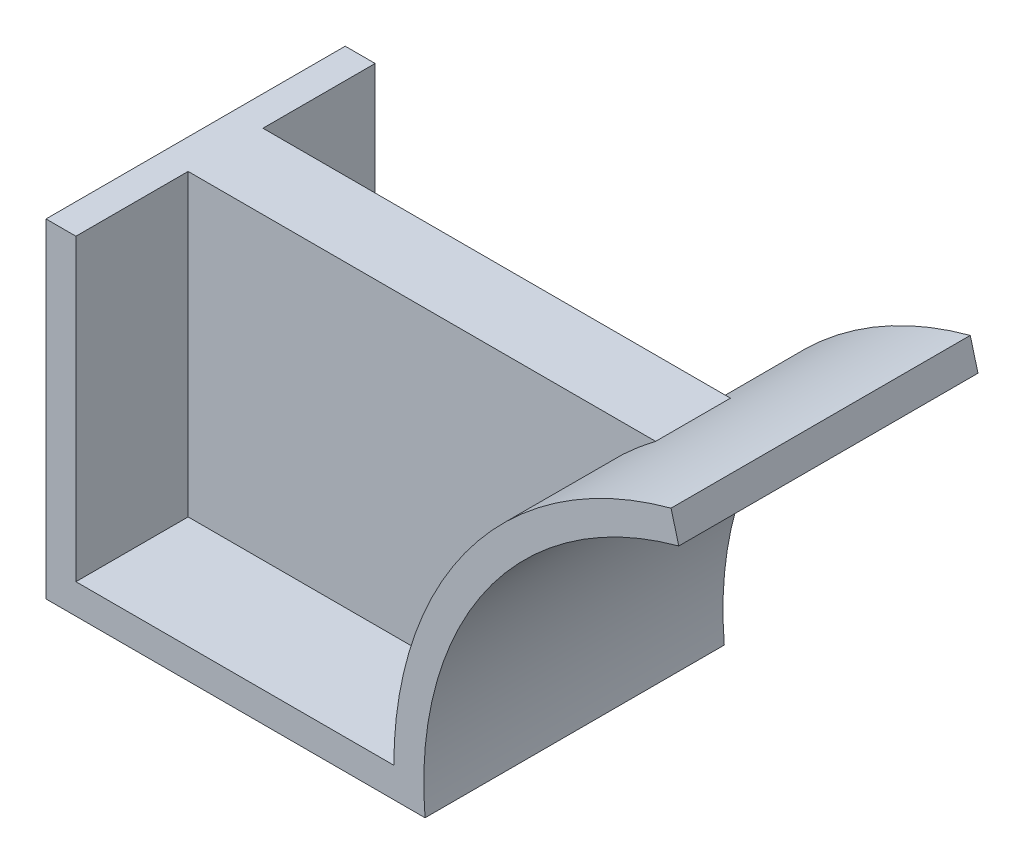
ISO-10303-21;
HEADER;
FILE_DESCRIPTION(('STEP AP214'),'2;1');
FILE_NAME('part.step','',(''),(''),'','','');
FILE_SCHEMA(('AUTOMOTIVE_DESIGN { 1 0 10303 214 1 1 1 1 }'));
ENDSEC;
DATA;
#1=APPLICATION_CONTEXT('core data for automotive mechanical design processes');
#2=APPLICATION_PROTOCOL_DEFINITION('international standard','automotive_design',2000,#1);
#3=PRODUCT_CONTEXT('',#1,'mechanical');
#4=PRODUCT('Part','Part','',(#3));
#5=PRODUCT_RELATED_PRODUCT_CATEGORY('part','',(#4));
#6=PRODUCT_DEFINITION_FORMATION('','',#4);
#7=PRODUCT_DEFINITION_CONTEXT('part definition',#1,'design');
#8=PRODUCT_DEFINITION('design','',#6,#7);
#9=PRODUCT_DEFINITION_SHAPE('','',#8);
#10=(LENGTH_UNIT() NAMED_UNIT(*) SI_UNIT(.MILLI.,.METRE.));
#11=(NAMED_UNIT(*) PLANE_ANGLE_UNIT() SI_UNIT($,.RADIAN.));
#12=(NAMED_UNIT(*) SI_UNIT($,.STERADIAN.) SOLID_ANGLE_UNIT());
#13=UNCERTAINTY_MEASURE_WITH_UNIT(LENGTH_MEASURE(1.E-05),#10,'distance_accuracy_value','');
#14=(GEOMETRIC_REPRESENTATION_CONTEXT(3) GLOBAL_UNCERTAINTY_ASSIGNED_CONTEXT((#13)) GLOBAL_UNIT_ASSIGNED_CONTEXT((#10,
#11,#12)) REPRESENTATION_CONTEXT('',''));
#15=CARTESIAN_POINT('',(0.,0.,0.));
#16=DIRECTION('',(0.,0.,1.));
#17=DIRECTION('',(1.,0.,0.));
#18=AXIS2_PLACEMENT_3D('',#15,#16,#17);
#19=CARTESIAN_POINT('',(185.,0.,80.));
#20=DIRECTION('',(0.,0.,-1.));
#21=DIRECTION('',(-1.,0.,0.));
#22=AXIS2_PLACEMENT_3D('',#19,#20,#21);
#23=CYLINDRICAL_SURFACE('',#22,100.);
#24=DIRECTION('',(0.,0.,-1.));
#25=VECTOR('',#24,1.);
#26=CARTESIAN_POINT('',(85.,0.,80.));
#27=LINE('',#26,#25);
#28=CARTESIAN_POINT('',(85.,0.,29.9999999999999));
#29=VERTEX_POINT('',#28);
#30=CARTESIAN_POINT('',(85.,0.,0.));
#31=VERTEX_POINT('',#30);
#32=EDGE_CURVE('E171',#29,#31,#27,.T.);
#33=ORIENTED_EDGE('',*,*,#32,.F.);
#34=CARTESIAN_POINT('',(185.,0.,30.));
#35=DIRECTION('',(0.,0.,1.));
#36=DIRECTION('',(0.,-1.,0.));
#37=AXIS2_PLACEMENT_3D('',#34,#35,#36);
#38=CIRCLE('',#37,100.);
#39=CARTESIAN_POINT('',(125.,80.,30.));
#40=VERTEX_POINT('',#39);
#41=EDGE_CURVE('E199',#40,#29,#38,.T.);
#42=ORIENTED_EDGE('',*,*,#41,.F.);
#43=DIRECTION('',(0.,0.,-1.));
#44=VECTOR('',#43,1.);
#45=CARTESIAN_POINT('',(125.,80.,80.));
#46=LINE('',#45,#44);
#47=CARTESIAN_POINT('',(125.,80.,50.));
#48=VERTEX_POINT('',#47);
#49=EDGE_CURVE('E227',#48,#40,#46,.T.);
#50=ORIENTED_EDGE('',*,*,#49,.F.);
#51=CARTESIAN_POINT('',(185.,0.,50.));
#52=DIRECTION('',(0.,0.,-1.));
#53=DIRECTION('',(-1.,0.,0.));
#54=AXIS2_PLACEMENT_3D('',#51,#52,#53);
#55=CIRCLE('',#54,100.);
#56=CARTESIAN_POINT('',(85.,0.,50.));
#57=VERTEX_POINT('',#56);
#58=EDGE_CURVE('E147',#57,#48,#55,.T.);
#59=ORIENTED_EDGE('',*,*,#58,.F.);
#60=CARTESIAN_POINT('',(85.,0.,80.));
#61=VERTEX_POINT('',#60);
#62=EDGE_CURVE('E172',#61,#57,#27,.T.);
#63=ORIENTED_EDGE('',*,*,#62,.F.);
#64=CARTESIAN_POINT('',(185.,0.,80.));
#65=DIRECTION('',(0.,0.,-1.));
#66=DIRECTION('',(-1.,0.,0.));
#67=AXIS2_PLACEMENT_3D('',#64,#65,#66);
#68=CIRCLE('',#67,100.);
#69=CARTESIAN_POINT('',(159.118095489748,96.5925826289067,80.));
#70=VERTEX_POINT('',#69);
#71=EDGE_CURVE('E180',#61,#70,#68,.T.);
#72=ORIENTED_EDGE('',*,*,#71,.T.);
#73=DIRECTION('',(0.,0.,-1.));
#74=VECTOR('',#73,1.);
#75=CARTESIAN_POINT('',(159.118095489748,96.5925826289067,80.));
#76=LINE('',#75,#74);
#77=CARTESIAN_POINT('',(159.118095489748,96.5925826289067,0.));
#78=VERTEX_POINT('',#77);
#79=EDGE_CURVE('E41',#70,#78,#76,.T.);
#80=ORIENTED_EDGE('',*,*,#79,.T.);
#81=CARTESIAN_POINT('',(185.,0.,0.));
#82=DIRECTION('',(0.,0.,-1.));
#83=DIRECTION('',(-1.,0.,0.));
#84=AXIS2_PLACEMENT_3D('',#81,#82,#83);
#85=CIRCLE('',#84,100.);
#86=EDGE_CURVE('E150',#31,#78,#85,.T.);
#87=ORIENTED_EDGE('',*,*,#86,.F.);
#88=EDGE_LOOP('',(#33,#42,#50,#59,#63,#72,#80,#87));
#89=FACE_BOUND('',#88,.T.);
#90=ADVANCED_FACE('F33',(#89),#23,.T.);
#91=CARTESIAN_POINT('',(0.,0.,80.));
#92=DIRECTION('',(0.,1.,0.));
#93=DIRECTION('',(0.,0.,1.));
#94=AXIS2_PLACEMENT_3D('',#91,#92,#93);
#95=PLANE('',#94);
#96=DIRECTION('',(0.,0.,-1.));
#97=VECTOR('',#96,1.);
#98=CARTESIAN_POINT('',(0.,0.,80.));
#99=LINE('',#98,#97);
#100=CARTESIAN_POINT('',(0.,0.,30.));
#101=VERTEX_POINT('',#100);
#102=CARTESIAN_POINT('',(0.,0.,0.));
#103=VERTEX_POINT('',#102);
#104=EDGE_CURVE('E167',#101,#103,#99,.T.);
#105=ORIENTED_EDGE('',*,*,#104,.F.);
#106=DIRECTION('',(-1.,0.,0.));
#107=VECTOR('',#106,1.);
#108=CARTESIAN_POINT('',(161.189647850568,0.,30.));
#109=LINE('',#108,#107);
#110=EDGE_CURVE('E194',#29,#101,#109,.T.);
#111=ORIENTED_EDGE('',*,*,#110,.F.);
#112=ORIENTED_EDGE('',*,*,#32,.T.);
#113=DIRECTION('',(1.,0.,0.));
#114=VECTOR('',#113,1.);
#115=CARTESIAN_POINT('',(0.,0.,0.));
#116=LINE('',#115,#114);
#117=EDGE_CURVE('E153',#103,#31,#116,.T.);
#118=ORIENTED_EDGE('',*,*,#117,.F.);
#119=EDGE_LOOP('',(#105,#111,#112,#118));
#120=FACE_BOUND('',#119,.T.);
#121=ADVANCED_FACE('F191',(#120),#95,.T.);
#122=ORIENTED_EDGE('',*,*,#62,.T.);
#123=DIRECTION('',(-1.,0.,0.));
#124=VECTOR('',#123,1.);
#125=CARTESIAN_POINT('',(161.189647850568,0.,50.));
#126=LINE('',#125,#124);
#127=CARTESIAN_POINT('',(0.,0.,50.));
#128=VERTEX_POINT('',#127);
#129=EDGE_CURVE('E220',#57,#128,#126,.T.);
#130=ORIENTED_EDGE('',*,*,#129,.T.);
#131=CARTESIAN_POINT('',(0.,0.,80.));
#132=VERTEX_POINT('',#131);
#133=EDGE_CURVE('E168',#132,#128,#99,.T.);
#134=ORIENTED_EDGE('',*,*,#133,.F.);
#135=DIRECTION('',(1.,0.,0.));
#136=VECTOR('',#135,1.);
#137=CARTESIAN_POINT('',(0.,0.,80.));
#138=LINE('',#137,#136);
#139=EDGE_CURVE('E137',#132,#61,#138,.T.);
#140=ORIENTED_EDGE('',*,*,#139,.T.);
#141=EDGE_LOOP('',(#122,#130,#134,#140));
#142=FACE_BOUND('',#141,.T.);
#143=ADVANCED_FACE('F225',(#142),#95,.T.);
#144=CARTESIAN_POINT('',(0.,80.,80.));
#145=DIRECTION('',(1.,0.,0.));
#146=DIRECTION('',(0.,0.,-1.));
#147=AXIS2_PLACEMENT_3D('',#144,#145,#146);
#148=PLANE('',#147);
#149=DIRECTION('',(0.,0.,-1.));
#150=VECTOR('',#149,1.);
#151=CARTESIAN_POINT('',(0.,80.,80.));
#152=LINE('',#151,#150);
#153=CARTESIAN_POINT('',(0.,80.,30.));
#154=VERTEX_POINT('',#153);
#155=CARTESIAN_POINT('',(0.,80.,0.));
#156=VERTEX_POINT('',#155);
#157=EDGE_CURVE('E124',#154,#156,#152,.T.);
#158=ORIENTED_EDGE('',*,*,#157,.F.);
#159=DIRECTION('',(0.,1.,0.));
#160=VECTOR('',#159,1.);
#161=CARTESIAN_POINT('',(0.,0.,30.));
#162=LINE('',#161,#160);
#163=EDGE_CURVE('E48',#101,#154,#162,.T.);
#164=ORIENTED_EDGE('',*,*,#163,.F.);
#165=ORIENTED_EDGE('',*,*,#104,.T.);
#166=DIRECTION('',(0.,-1.,0.));
#167=VECTOR('',#166,1.);
#168=CARTESIAN_POINT('',(0.,80.,0.));
#169=LINE('',#168,#167);
#170=EDGE_CURVE('E156',#156,#103,#169,.T.);
#171=ORIENTED_EDGE('',*,*,#170,.F.);
#172=EDGE_LOOP('',(#158,#164,#165,#171));
#173=FACE_BOUND('',#172,.T.);
#174=ADVANCED_FACE('F245',(#173),#148,.T.);
#175=ORIENTED_EDGE('',*,*,#133,.T.);
#176=DIRECTION('',(0.,-1.,0.));
#177=VECTOR('',#176,1.);
#178=CARTESIAN_POINT('',(0.,0.,50.));
#179=LINE('',#178,#177);
#180=CARTESIAN_POINT('',(0.,80.,50.));
#181=VERTEX_POINT('',#180);
#182=EDGE_CURVE('E217',#181,#128,#179,.T.);
#183=ORIENTED_EDGE('',*,*,#182,.F.);
#184=CARTESIAN_POINT('',(0.,80.,80.));
#185=VERTEX_POINT('',#184);
#186=EDGE_CURVE('E165',#185,#181,#152,.T.);
#187=ORIENTED_EDGE('',*,*,#186,.F.);
#188=DIRECTION('',(0.,-1.,0.));
#189=VECTOR('',#188,1.);
#190=CARTESIAN_POINT('',(0.,80.,80.));
#191=LINE('',#190,#189);
#192=EDGE_CURVE('E135',#185,#132,#191,.T.);
#193=ORIENTED_EDGE('',*,*,#192,.T.);
#194=EDGE_LOOP('',(#175,#183,#187,#193));
#195=FACE_BOUND('',#194,.T.);
#196=ADVANCED_FACE('F229',(#195),#148,.T.);
#197=CARTESIAN_POINT('',(185.,0.,80.));
#198=DIRECTION('',(0.,0.,-1.));
#199=DIRECTION('',(-1.,0.,0.));
#200=AXIS2_PLACEMENT_3D('',#197,#198,#199);
#201=CYLINDRICAL_SURFACE('',#200,92.);
#202=CARTESIAN_POINT('',(185.,0.,0.));
#203=DIRECTION('',(0.,0.,1.));
#204=DIRECTION('',(1.,0.,0.));
#205=AXIS2_PLACEMENT_3D('',#202,#203,#204);
#206=CIRCLE('',#205,92.);
#207=CARTESIAN_POINT('',(93.3484861008832,-8.,0.));
#208=VERTEX_POINT('',#207);
#209=CARTESIAN_POINT('',(161.188647850568,88.8651760185942,0.));
#210=VERTEX_POINT('',#209);
#211=EDGE_CURVE('E143',#208,#210,#206,.F.);
#212=ORIENTED_EDGE('',*,*,#211,.T.);
#213=DIRECTION('',(0.,0.,-1.));
#214=VECTOR('',#213,1.);
#215=CARTESIAN_POINT('',(161.188647850568,88.8651760185942,80.));
#216=LINE('',#215,#214);
#217=CARTESIAN_POINT('',(161.188647850568,88.8651760185942,80.));
#218=VERTEX_POINT('',#217);
#219=EDGE_CURVE('E11',#218,#210,#216,.T.);
#220=ORIENTED_EDGE('',*,*,#219,.F.);
#221=CARTESIAN_POINT('',(185.,0.,80.));
#222=DIRECTION('',(0.,0.,1.));
#223=DIRECTION('',(1.,0.,0.));
#224=AXIS2_PLACEMENT_3D('',#221,#222,#223);
#225=CIRCLE('',#224,92.);
#226=CARTESIAN_POINT('',(93.3484861008832,-8.,80.));
#227=VERTEX_POINT('',#226);
#228=EDGE_CURVE('E95',#227,#218,#225,.F.);
#229=ORIENTED_EDGE('',*,*,#228,.F.);
#230=DIRECTION('',(0.,0.,-1.));
#231=VECTOR('',#230,1.);
#232=CARTESIAN_POINT('',(93.3484861008832,-8.,80.));
#233=LINE('',#232,#231);
#234=EDGE_CURVE('E142',#227,#208,#233,.T.);
#235=ORIENTED_EDGE('',*,*,#234,.T.);
#236=EDGE_LOOP('',(#212,#220,#229,#235));
#237=FACE_BOUND('',#236,.T.);
#238=ADVANCED_FACE('F35',(#237),#201,.F.);
#239=CARTESIAN_POINT('',(159.118095489748,96.5925826289067,80.));
#240=DIRECTION('',(0.965925826289067,0.258819045102526,0.));
#241=DIRECTION('',(-0.258819045102526,0.965925826289067,0.));
#242=AXIS2_PLACEMENT_3D('',#239,#240,#241);
#243=PLANE('',#242);
#244=DIRECTION('',(0.258819045102526,-0.965925826289067,0.));
#245=VECTOR('',#244,1.);
#246=CARTESIAN_POINT('',(159.118095489748,96.5925826289067,0.));
#247=LINE('',#246,#245);
#248=EDGE_CURVE('E146',#78,#210,#247,.T.);
#249=ORIENTED_EDGE('',*,*,#248,.F.);
#250=ORIENTED_EDGE('',*,*,#79,.F.);
#251=DIRECTION('',(0.258819045102526,-0.965925826289067,0.));
#252=VECTOR('',#251,1.);
#253=CARTESIAN_POINT('',(159.118095489748,96.5925826289067,80.));
#254=LINE('',#253,#252);
#255=EDGE_CURVE('E238',#70,#218,#254,.T.);
#256=ORIENTED_EDGE('',*,*,#255,.T.);
#257=ORIENTED_EDGE('',*,*,#219,.T.);
#258=EDGE_LOOP('',(#249,#250,#256,#257));
#259=FACE_BOUND('',#258,.T.);
#260=ADVANCED_FACE('F183',(#259),#243,.T.);
#261=CARTESIAN_POINT('',(-8.,80.,80.));
#262=DIRECTION('',(0.,1.,0.));
#263=DIRECTION('',(0.,0.,1.));
#264=AXIS2_PLACEMENT_3D('',#261,#262,#263);
#265=PLANE('',#264);
#266=DIRECTION('',(1.,0.,0.));
#267=VECTOR('',#266,1.);
#268=CARTESIAN_POINT('',(-8.,80.,0.));
#269=LINE('',#268,#267);
#270=CARTESIAN_POINT('',(-8.,80.,0.));
#271=VERTEX_POINT('',#270);
#272=EDGE_CURVE('E121',#271,#156,#269,.T.);
#273=ORIENTED_EDGE('',*,*,#272,.F.);
#274=DIRECTION('',(0.,0.,-1.));
#275=VECTOR('',#274,1.);
#276=CARTESIAN_POINT('',(-8.,80.,80.));
#277=LINE('',#276,#275);
#278=CARTESIAN_POINT('',(-8.,80.,80.));
#279=VERTEX_POINT('',#278);
#280=EDGE_CURVE('E114',#279,#271,#277,.T.);
#281=ORIENTED_EDGE('',*,*,#280,.F.);
#282=DIRECTION('',(1.,0.,0.));
#283=VECTOR('',#282,1.);
#284=CARTESIAN_POINT('',(-8.,80.,80.));
#285=LINE('',#284,#283);
#286=EDGE_CURVE('E119',#279,#185,#285,.T.);
#287=ORIENTED_EDGE('',*,*,#286,.T.);
#288=ORIENTED_EDGE('',*,*,#186,.T.);
#289=DIRECTION('',(-1.,0.,0.));
#290=VECTOR('',#289,1.);
#291=CARTESIAN_POINT('',(161.189647850568,80.,50.));
#292=LINE('',#291,#290);
#293=EDGE_CURVE('E221',#48,#181,#292,.T.);
#294=ORIENTED_EDGE('',*,*,#293,.F.);
#295=ORIENTED_EDGE('',*,*,#49,.T.);
#296=DIRECTION('',(-1.,0.,0.));
#297=VECTOR('',#296,1.);
#298=CARTESIAN_POINT('',(161.189647850568,80.,30.));
#299=LINE('',#298,#297);
#300=EDGE_CURVE('E231',#40,#154,#299,.T.);
#301=ORIENTED_EDGE('',*,*,#300,.T.);
#302=ORIENTED_EDGE('',*,*,#157,.T.);
#303=EDGE_LOOP('',(#273,#281,#287,#288,#294,#295,#301,#302));
#304=FACE_BOUND('',#303,.T.);
#305=ADVANCED_FACE('F116',(#304),#265,.T.);
#306=CARTESIAN_POINT('',(-8.,80.,80.));
#307=DIRECTION('',(1.,0.,0.));
#308=DIRECTION('',(0.,0.,-1.));
#309=AXIS2_PLACEMENT_3D('',#306,#307,#308);
#310=PLANE('',#309);
#311=DIRECTION('',(0.,1.,0.));
#312=VECTOR('',#311,1.);
#313=CARTESIAN_POINT('',(-8.,80.,0.));
#314=LINE('',#313,#312);
#315=CARTESIAN_POINT('',(-8.,-8.,0.));
#316=VERTEX_POINT('',#315);
#317=EDGE_CURVE('E160',#271,#316,#314,.F.);
#318=ORIENTED_EDGE('',*,*,#317,.T.);
#319=DIRECTION('',(0.,0.,-1.));
#320=VECTOR('',#319,1.);
#321=CARTESIAN_POINT('',(-8.,-8.,80.));
#322=LINE('',#321,#320);
#323=CARTESIAN_POINT('',(-8.,-8.,80.));
#324=VERTEX_POINT('',#323);
#325=EDGE_CURVE('E125',#324,#316,#322,.T.);
#326=ORIENTED_EDGE('',*,*,#325,.F.);
#327=DIRECTION('',(0.,1.,0.));
#328=VECTOR('',#327,1.);
#329=CARTESIAN_POINT('',(-8.,80.,80.));
#330=LINE('',#329,#328);
#331=EDGE_CURVE('E128',#279,#324,#330,.F.);
#332=ORIENTED_EDGE('',*,*,#331,.F.);
#333=ORIENTED_EDGE('',*,*,#280,.T.);
#334=EDGE_LOOP('',(#318,#326,#332,#333));
#335=FACE_BOUND('',#334,.T.);
#336=ADVANCED_FACE('F129',(#335),#310,.F.);
#337=CARTESIAN_POINT('',(0.,-8.,80.));
#338=DIRECTION('',(0.,1.,0.));
#339=DIRECTION('',(0.,0.,1.));
#340=AXIS2_PLACEMENT_3D('',#337,#338,#339);
#341=PLANE('',#340);
#342=DIRECTION('',(1.,0.,0.));
#343=VECTOR('',#342,1.);
#344=CARTESIAN_POINT('',(0.,-8.,0.));
#345=LINE('',#344,#343);
#346=EDGE_CURVE('E89',#316,#208,#345,.T.);
#347=ORIENTED_EDGE('',*,*,#346,.T.);
#348=ORIENTED_EDGE('',*,*,#234,.F.);
#349=DIRECTION('',(1.,0.,0.));
#350=VECTOR('',#349,1.);
#351=CARTESIAN_POINT('',(0.,-8.,80.));
#352=LINE('',#351,#350);
#353=EDGE_CURVE('E57',#324,#227,#352,.T.);
#354=ORIENTED_EDGE('',*,*,#353,.F.);
#355=ORIENTED_EDGE('',*,*,#325,.T.);
#356=EDGE_LOOP('',(#347,#348,#354,#355));
#357=FACE_BOUND('',#356,.T.);
#358=ADVANCED_FACE('F246',(#357),#341,.F.);
#359=CARTESIAN_POINT('',(185.,0.,80.));
#360=DIRECTION('',(0.,0.,1.));
#361=DIRECTION('',(1.,0.,0.));
#362=AXIS2_PLACEMENT_3D('',#359,#360,#361);
#363=PLANE('',#362);
#364=ORIENTED_EDGE('',*,*,#228,.T.);
#365=ORIENTED_EDGE('',*,*,#255,.F.);
#366=ORIENTED_EDGE('',*,*,#71,.F.);
#367=ORIENTED_EDGE('',*,*,#139,.F.);
#368=ORIENTED_EDGE('',*,*,#192,.F.);
#369=ORIENTED_EDGE('',*,*,#286,.F.);
#370=ORIENTED_EDGE('',*,*,#331,.T.);
#371=ORIENTED_EDGE('',*,*,#353,.T.);
#372=EDGE_LOOP('',(#364,#365,#366,#367,#368,#369,#370,#371));
#373=FACE_BOUND('',#372,.T.);
#374=ADVANCED_FACE('F132',(#373),#363,.T.);
#375=CARTESIAN_POINT('',(185.,0.,0.));
#376=DIRECTION('',(0.,0.,1.));
#377=DIRECTION('',(1.,0.,0.));
#378=AXIS2_PLACEMENT_3D('',#375,#376,#377);
#379=PLANE('',#378);
#380=ORIENTED_EDGE('',*,*,#211,.F.);
#381=ORIENTED_EDGE('',*,*,#346,.F.);
#382=ORIENTED_EDGE('',*,*,#317,.F.);
#383=ORIENTED_EDGE('',*,*,#272,.T.);
#384=ORIENTED_EDGE('',*,*,#170,.T.);
#385=ORIENTED_EDGE('',*,*,#117,.T.);
#386=ORIENTED_EDGE('',*,*,#86,.T.);
#387=ORIENTED_EDGE('',*,*,#248,.T.);
#388=EDGE_LOOP('',(#380,#381,#382,#383,#384,#385,#386,#387));
#389=FACE_BOUND('',#388,.T.);
#390=ADVANCED_FACE('F186',(#389),#379,.F.);
#391=CARTESIAN_POINT('',(161.189647850568,0.,30.));
#392=DIRECTION('',(0.,0.,1.));
#393=DIRECTION('',(0.,-1.,0.));
#394=AXIS2_PLACEMENT_3D('',#391,#392,#393);
#395=PLANE('',#394);
#396=ORIENTED_EDGE('',*,*,#300,.F.);
#397=ORIENTED_EDGE('',*,*,#41,.T.);
#398=ORIENTED_EDGE('',*,*,#110,.T.);
#399=ORIENTED_EDGE('',*,*,#163,.T.);
#400=EDGE_LOOP('',(#396,#397,#398,#399));
#401=FACE_BOUND('',#400,.T.);
#402=ADVANCED_FACE('F270',(#401),#395,.F.);
#403=CARTESIAN_POINT('',(161.189647850568,0.,50.));
#404=DIRECTION('',(0.,0.,-1.));
#405=DIRECTION('',(-1.,0.,0.));
#406=AXIS2_PLACEMENT_3D('',#403,#404,#405);
#407=PLANE('',#406);
#408=ORIENTED_EDGE('',*,*,#129,.F.);
#409=ORIENTED_EDGE('',*,*,#58,.T.);
#410=ORIENTED_EDGE('',*,*,#293,.T.);
#411=ORIENTED_EDGE('',*,*,#182,.T.);
#412=EDGE_LOOP('',(#408,#409,#410,#411));
#413=FACE_BOUND('',#412,.T.);
#414=ADVANCED_FACE('F219',(#413),#407,.F.);
#415=CLOSED_SHELL('',(#90,#121,#143,#174,#196,#238,#260,#305,#336,#358,#374,#390,#402,#414));
#416=MANIFOLD_SOLID_BREP('B2',#415);
#417=ADVANCED_BREP_SHAPE_REPRESENTATION('',(#18,#416),#14);
#418=SHAPE_DEFINITION_REPRESENTATION(#9,#417);
ENDSEC;
END-ISO-10303-21;
